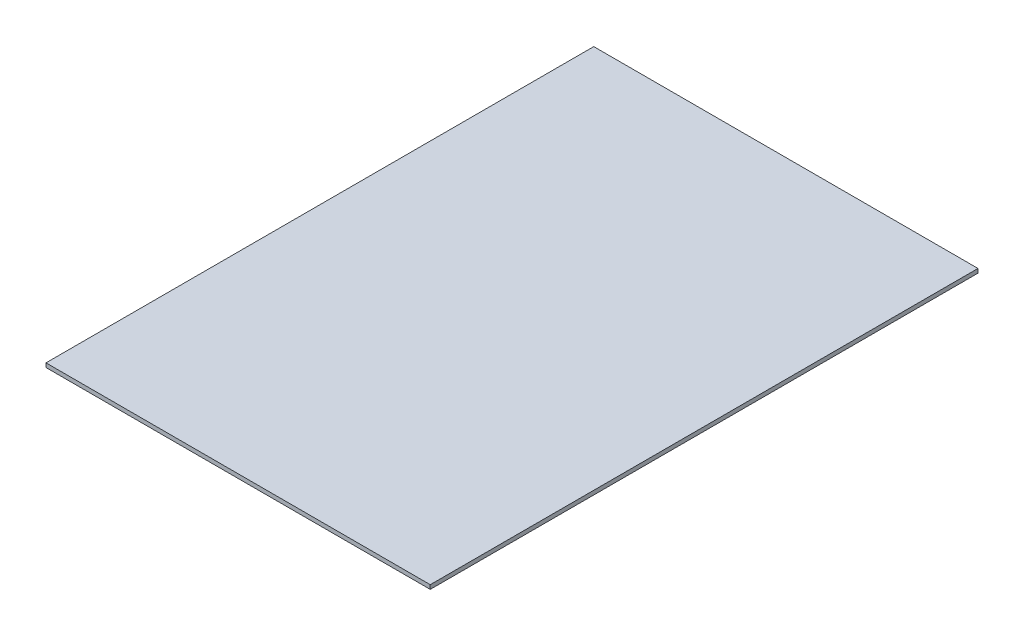
ISO-10303-21;
HEADER;
FILE_DESCRIPTION(('STEP AP214'),'2;1');
FILE_NAME('part.step','',(''),(''),'','','');
FILE_SCHEMA(('AUTOMOTIVE_DESIGN { 1 0 10303 214 1 1 1 1 }'));
ENDSEC;
DATA;
#1=APPLICATION_CONTEXT('core data for automotive mechanical design processes');
#2=APPLICATION_PROTOCOL_DEFINITION('international standard','automotive_design',2000,#1);
#3=PRODUCT_CONTEXT('',#1,'mechanical');
#4=PRODUCT('Part','Part','',(#3));
#5=PRODUCT_RELATED_PRODUCT_CATEGORY('part','',(#4));
#6=PRODUCT_DEFINITION_FORMATION('','',#4);
#7=PRODUCT_DEFINITION_CONTEXT('part definition',#1,'design');
#8=PRODUCT_DEFINITION('design','',#6,#7);
#9=PRODUCT_DEFINITION_SHAPE('','',#8);
#10=(LENGTH_UNIT() NAMED_UNIT(*) SI_UNIT(.MILLI.,.METRE.));
#11=(NAMED_UNIT(*) PLANE_ANGLE_UNIT() SI_UNIT($,.RADIAN.));
#12=(NAMED_UNIT(*) SI_UNIT($,.STERADIAN.) SOLID_ANGLE_UNIT());
#13=UNCERTAINTY_MEASURE_WITH_UNIT(LENGTH_MEASURE(1.E-05),#10,'distance_accuracy_value','');
#14=(GEOMETRIC_REPRESENTATION_CONTEXT(3) GLOBAL_UNCERTAINTY_ASSIGNED_CONTEXT((#13)) GLOBAL_UNIT_ASSIGNED_CONTEXT((#10,
#11,#12)) REPRESENTATION_CONTEXT('',''));
#15=CARTESIAN_POINT('',(0.,0.,0.));
#16=DIRECTION('',(0.,0.,1.));
#17=DIRECTION('',(1.,0.,0.));
#18=AXIS2_PLACEMENT_3D('',#15,#16,#17);
#19=CARTESIAN_POINT('',(0.,5.,0.));
#20=DIRECTION('',(-1.,0.,0.));
#21=DIRECTION('',(0.,0.,1.));
#22=AXIS2_PLACEMENT_3D('',#19,#20,#21);
#23=PLANE('',#22);
#24=DIRECTION('',(0.,0.,-1.));
#25=VECTOR('',#24,1.);
#26=CARTESIAN_POINT('',(0.,0.,0.));
#27=LINE('',#26,#25);
#28=CARTESIAN_POINT('',(0.,0.,0.));
#29=VERTEX_POINT('',#28);
#30=CARTESIAN_POINT('',(0.,0.,-670.));
#31=VERTEX_POINT('',#30);
#32=EDGE_CURVE('E98',#29,#31,#27,.T.);
#33=ORIENTED_EDGE('',*,*,#32,.T.);
#34=DIRECTION('',(0.,-1.,0.));
#35=VECTOR('',#34,1.);
#36=CARTESIAN_POINT('',(0.,5.,-670.));
#37=LINE('',#36,#35);
#38=CARTESIAN_POINT('',(0.,5.,-670.));
#39=VERTEX_POINT('',#38);
#40=EDGE_CURVE('E11',#39,#31,#37,.T.);
#41=ORIENTED_EDGE('',*,*,#40,.F.);
#42=DIRECTION('',(0.,0.,-1.));
#43=VECTOR('',#42,1.);
#44=CARTESIAN_POINT('',(0.,5.,0.));
#45=LINE('',#44,#43);
#46=CARTESIAN_POINT('',(0.,5.,0.));
#47=VERTEX_POINT('',#46);
#48=EDGE_CURVE('E86',#47,#39,#45,.T.);
#49=ORIENTED_EDGE('',*,*,#48,.F.);
#50=DIRECTION('',(0.,-1.,0.));
#51=VECTOR('',#50,1.);
#52=CARTESIAN_POINT('',(0.,5.,0.));
#53=LINE('',#52,#51);
#54=EDGE_CURVE('E94',#47,#29,#53,.T.);
#55=ORIENTED_EDGE('',*,*,#54,.T.);
#56=EDGE_LOOP('',(#33,#41,#49,#55));
#57=FACE_BOUND('',#56,.T.);
#58=ADVANCED_FACE('F35',(#57),#23,.F.);
#59=CARTESIAN_POINT('',(0.,5.,-670.));
#60=DIRECTION('',(0.,0.,1.));
#61=DIRECTION('',(1.,0.,0.));
#62=AXIS2_PLACEMENT_3D('',#59,#60,#61);
#63=PLANE('',#62);
#64=DIRECTION('',(-1.,0.,0.));
#65=VECTOR('',#64,1.);
#66=CARTESIAN_POINT('',(0.,0.,-670.));
#67=LINE('',#66,#65);
#68=CARTESIAN_POINT('',(-470.,0.,-670.));
#69=VERTEX_POINT('',#68);
#70=EDGE_CURVE('E90',#31,#69,#67,.T.);
#71=ORIENTED_EDGE('',*,*,#70,.T.);
#72=DIRECTION('',(0.,-1.,0.));
#73=VECTOR('',#72,1.);
#74=CARTESIAN_POINT('',(-470.,5.,-670.));
#75=LINE('',#74,#73);
#76=CARTESIAN_POINT('',(-470.,5.,-670.));
#77=VERTEX_POINT('',#76);
#78=EDGE_CURVE('E43',#77,#69,#75,.T.);
#79=ORIENTED_EDGE('',*,*,#78,.F.);
#80=DIRECTION('',(-1.,0.,0.));
#81=VECTOR('',#80,1.);
#82=CARTESIAN_POINT('',(0.,5.,-670.));
#83=LINE('',#82,#81);
#84=EDGE_CURVE('E81',#39,#77,#83,.T.);
#85=ORIENTED_EDGE('',*,*,#84,.F.);
#86=ORIENTED_EDGE('',*,*,#40,.T.);
#87=EDGE_LOOP('',(#71,#79,#85,#86));
#88=FACE_BOUND('',#87,.T.);
#89=ADVANCED_FACE('F89',(#88),#63,.F.);
#90=CARTESIAN_POINT('',(-470.,5.,0.));
#91=DIRECTION('',(1.,0.,0.));
#92=DIRECTION('',(0.,0.,-1.));
#93=AXIS2_PLACEMENT_3D('',#90,#91,#92);
#94=PLANE('',#93);
#95=DIRECTION('',(0.,0.,1.));
#96=VECTOR('',#95,1.);
#97=CARTESIAN_POINT('',(-470.,0.,0.));
#98=LINE('',#97,#96);
#99=CARTESIAN_POINT('',(-470.,0.,0.));
#100=VERTEX_POINT('',#99);
#101=EDGE_CURVE('E68',#69,#100,#98,.T.);
#102=ORIENTED_EDGE('',*,*,#101,.T.);
#103=DIRECTION('',(0.,-1.,0.));
#104=VECTOR('',#103,1.);
#105=CARTESIAN_POINT('',(-470.,5.,0.));
#106=LINE('',#105,#104);
#107=CARTESIAN_POINT('',(-470.,5.,0.));
#108=VERTEX_POINT('',#107);
#109=EDGE_CURVE('E91',#108,#100,#106,.T.);
#110=ORIENTED_EDGE('',*,*,#109,.F.);
#111=DIRECTION('',(0.,0.,1.));
#112=VECTOR('',#111,1.);
#113=CARTESIAN_POINT('',(-470.,5.,0.));
#114=LINE('',#113,#112);
#115=EDGE_CURVE('E84',#77,#108,#114,.T.);
#116=ORIENTED_EDGE('',*,*,#115,.F.);
#117=ORIENTED_EDGE('',*,*,#78,.T.);
#118=EDGE_LOOP('',(#102,#110,#116,#117));
#119=FACE_BOUND('',#118,.T.);
#120=ADVANCED_FACE('F92',(#119),#94,.F.);
#121=CARTESIAN_POINT('',(0.,5.,0.));
#122=DIRECTION('',(0.,0.,-1.));
#123=DIRECTION('',(-1.,0.,0.));
#124=AXIS2_PLACEMENT_3D('',#121,#122,#123);
#125=PLANE('',#124);
#126=DIRECTION('',(1.,0.,0.));
#127=VECTOR('',#126,1.);
#128=CARTESIAN_POINT('',(0.,0.,0.));
#129=LINE('',#128,#127);
#130=EDGE_CURVE('E74',#100,#29,#129,.T.);
#131=ORIENTED_EDGE('',*,*,#130,.T.);
#132=ORIENTED_EDGE('',*,*,#54,.F.);
#133=DIRECTION('',(1.,0.,0.));
#134=VECTOR('',#133,1.);
#135=CARTESIAN_POINT('',(0.,5.,0.));
#136=LINE('',#135,#134);
#137=EDGE_CURVE('E51',#108,#47,#136,.T.);
#138=ORIENTED_EDGE('',*,*,#137,.F.);
#139=ORIENTED_EDGE('',*,*,#109,.T.);
#140=EDGE_LOOP('',(#131,#132,#138,#139));
#141=FACE_BOUND('',#140,.T.);
#142=ADVANCED_FACE('F105',(#141),#125,.F.);
#143=CARTESIAN_POINT('',(0.,5.,0.));
#144=DIRECTION('',(0.,1.,0.));
#145=DIRECTION('',(0.,0.,1.));
#146=AXIS2_PLACEMENT_3D('',#143,#144,#145);
#147=PLANE('',#146);
#148=ORIENTED_EDGE('',*,*,#48,.T.);
#149=ORIENTED_EDGE('',*,*,#84,.T.);
#150=ORIENTED_EDGE('',*,*,#115,.T.);
#151=ORIENTED_EDGE('',*,*,#137,.T.);
#152=EDGE_LOOP('',(#148,#149,#150,#151));
#153=FACE_BOUND('',#152,.T.);
#154=ADVANCED_FACE('F82',(#153),#147,.T.);
#155=CARTESIAN_POINT('',(0.,0.,0.));
#156=DIRECTION('',(0.,1.,0.));
#157=DIRECTION('',(0.,0.,1.));
#158=AXIS2_PLACEMENT_3D('',#155,#156,#157);
#159=PLANE('',#158);
#160=ORIENTED_EDGE('',*,*,#32,.F.);
#161=ORIENTED_EDGE('',*,*,#130,.F.);
#162=ORIENTED_EDGE('',*,*,#101,.F.);
#163=ORIENTED_EDGE('',*,*,#70,.F.);
#164=EDGE_LOOP('',(#160,#161,#162,#163));
#165=FACE_BOUND('',#164,.T.);
#166=ADVANCED_FACE('F108',(#165),#159,.F.);
#167=CLOSED_SHELL('',(#58,#89,#120,#142,#154,#166));
#168=MANIFOLD_SOLID_BREP('B2',#167);
#169=ADVANCED_BREP_SHAPE_REPRESENTATION('',(#18,#168),#14);
#170=SHAPE_DEFINITION_REPRESENTATION(#9,#169);
ENDSEC;
END-ISO-10303-21;
